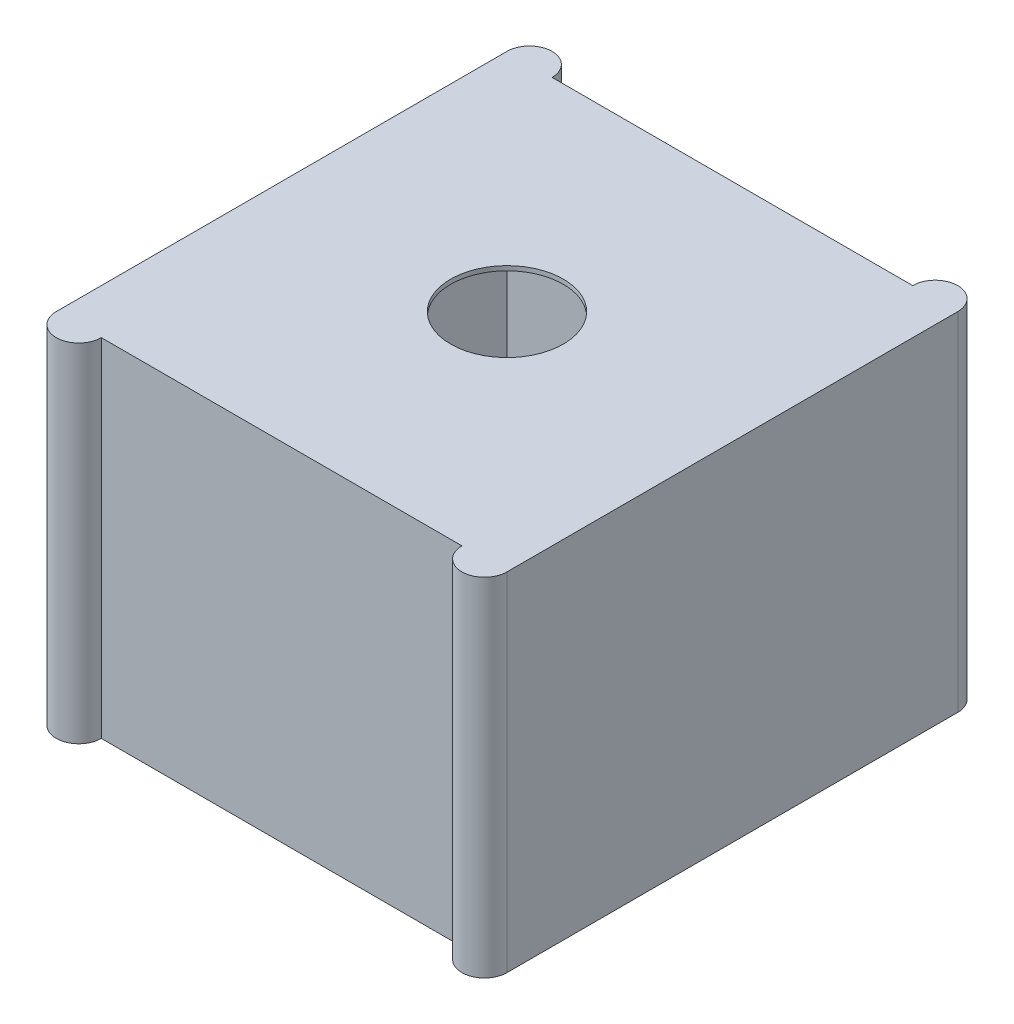
ISO-10303-21;
HEADER;
FILE_DESCRIPTION(('STEP AP214'),'2;1');
FILE_NAME('part.step','',(''),(''),'','','');
FILE_SCHEMA(('AUTOMOTIVE_DESIGN { 1 0 10303 214 1 1 1 1 }'));
ENDSEC;
DATA;
#1=APPLICATION_CONTEXT('core data for automotive mechanical design processes');
#2=APPLICATION_PROTOCOL_DEFINITION('international standard','automotive_design',2000,#1);
#3=PRODUCT_CONTEXT('',#1,'mechanical');
#4=PRODUCT('Part','Part','',(#3));
#5=PRODUCT_RELATED_PRODUCT_CATEGORY('part','',(#4));
#6=PRODUCT_DEFINITION_FORMATION('','',#4);
#7=PRODUCT_DEFINITION_CONTEXT('part definition',#1,'design');
#8=PRODUCT_DEFINITION('design','',#6,#7);
#9=PRODUCT_DEFINITION_SHAPE('','',#8);
#10=(LENGTH_UNIT() NAMED_UNIT(*) SI_UNIT(.MILLI.,.METRE.));
#11=(NAMED_UNIT(*) PLANE_ANGLE_UNIT() SI_UNIT($,.RADIAN.));
#12=(NAMED_UNIT(*) SI_UNIT($,.STERADIAN.) SOLID_ANGLE_UNIT());
#13=UNCERTAINTY_MEASURE_WITH_UNIT(LENGTH_MEASURE(1.E-05),#10,'distance_accuracy_value','');
#14=(GEOMETRIC_REPRESENTATION_CONTEXT(3) GLOBAL_UNCERTAINTY_ASSIGNED_CONTEXT((#13)) GLOBAL_UNIT_ASSIGNED_CONTEXT((#10,
#11,#12)) REPRESENTATION_CONTEXT('',''));
#15=CARTESIAN_POINT('',(0.,0.,0.));
#16=DIRECTION('',(0.,0.,1.));
#17=DIRECTION('',(1.,0.,0.));
#18=AXIS2_PLACEMENT_3D('',#15,#16,#17);
#19=CARTESIAN_POINT('',(0.,154.,0.));
#20=DIRECTION('',(0.,-1.,0.));
#21=DIRECTION('',(0.,0.,-1.));
#22=AXIS2_PLACEMENT_3D('',#19,#20,#21);
#23=CYLINDRICAL_SURFACE('',#22,25.);
#24=CARTESIAN_POINT('',(0.,0.,0.));
#25=DIRECTION('',(0.,1.,0.));
#26=DIRECTION('',(0.,0.,1.));
#27=AXIS2_PLACEMENT_3D('',#24,#25,#26);
#28=CIRCLE('',#27,25.);
#29=CARTESIAN_POINT('',(0.,0.,25.));
#30=VERTEX_POINT('',#29);
#31=EDGE_CURVE('E197',#30,#30,#28,.T.);
#32=ORIENTED_EDGE('',*,*,#31,.F.);
#33=EDGE_LOOP('',(#32));
#34=FACE_BOUND('',#33,.T.);
#35=CARTESIAN_POINT('',(0.,2.,0.));
#36=DIRECTION('',(0.,1.,0.));
#37=DIRECTION('',(0.,0.,1.));
#38=AXIS2_PLACEMENT_3D('',#35,#36,#37);
#39=CIRCLE('',#38,25.);
#40=CARTESIAN_POINT('',(0.,2.,25.));
#41=VERTEX_POINT('',#40);
#42=EDGE_CURVE('E43',#41,#41,#39,.T.);
#43=ORIENTED_EDGE('',*,*,#42,.T.);
#44=EDGE_LOOP('',(#43));
#45=FACE_BOUND('',#44,.T.);
#46=ADVANCED_FACE('F39',(#34,#45),#23,.F.);
#47=CARTESIAN_POINT('',(90.,154.,100.));
#48=DIRECTION('',(0.,-1.,0.));
#49=DIRECTION('',(0.,0.,-1.));
#50=AXIS2_PLACEMENT_3D('',#47,#48,#49);
#51=PLANE('',#50);
#52=CARTESIAN_POINT('',(90.,154.,100.));
#53=DIRECTION('',(0.,1.,0.));
#54=DIRECTION('',(0.,0.,-1.));
#55=AXIS2_PLACEMENT_3D('',#52,#53,#54);
#56=CIRCLE('',#55,9.99999999999999);
#57=CARTESIAN_POINT('',(80.,154.,100.));
#58=VERTEX_POINT('',#57);
#59=CARTESIAN_POINT('',(100.,154.,100.));
#60=VERTEX_POINT('',#59);
#61=EDGE_CURVE('E171',#58,#60,#56,.T.);
#62=ORIENTED_EDGE('',*,*,#61,.T.);
#63=DIRECTION('',(0.,0.,-1.));
#64=VECTOR('',#63,1.);
#65=CARTESIAN_POINT('',(100.,154.,-100.));
#66=LINE('',#65,#64);
#67=CARTESIAN_POINT('',(100.,154.,-100.));
#68=VERTEX_POINT('',#67);
#69=EDGE_CURVE('E103',#60,#68,#66,.T.);
#70=ORIENTED_EDGE('',*,*,#69,.T.);
#71=CARTESIAN_POINT('',(90.,154.,-100.));
#72=DIRECTION('',(0.,1.,0.));
#73=DIRECTION('',(0.,0.,1.));
#74=AXIS2_PLACEMENT_3D('',#71,#72,#73);
#75=CIRCLE('',#74,9.99999999999998);
#76=CARTESIAN_POINT('',(80.,154.,-100.));
#77=VERTEX_POINT('',#76);
#78=EDGE_CURVE('E232',#68,#77,#75,.T.);
#79=ORIENTED_EDGE('',*,*,#78,.T.);
#80=DIRECTION('',(-1.,0.,0.));
#81=VECTOR('',#80,1.);
#82=CARTESIAN_POINT('',(-80.,154.,-100.));
#83=LINE('',#82,#81);
#84=CARTESIAN_POINT('',(-80.,154.,-100.));
#85=VERTEX_POINT('',#84);
#86=EDGE_CURVE('E235',#77,#85,#83,.T.);
#87=ORIENTED_EDGE('',*,*,#86,.T.);
#88=CARTESIAN_POINT('',(-90.,154.,-100.));
#89=DIRECTION('',(0.,1.,0.));
#90=DIRECTION('',(0.,0.,-1.));
#91=AXIS2_PLACEMENT_3D('',#88,#89,#90);
#92=CIRCLE('',#91,9.99999999999999);
#93=CARTESIAN_POINT('',(-100.,154.,-100.));
#94=VERTEX_POINT('',#93);
#95=EDGE_CURVE('E126',#85,#94,#92,.T.);
#96=ORIENTED_EDGE('',*,*,#95,.T.);
#97=DIRECTION('',(0.,0.,1.));
#98=VECTOR('',#97,1.);
#99=CARTESIAN_POINT('',(-100.,154.,-100.));
#100=LINE('',#99,#98);
#101=CARTESIAN_POINT('',(-100.,154.,100.));
#102=VERTEX_POINT('',#101);
#103=EDGE_CURVE('E119',#94,#102,#100,.T.);
#104=ORIENTED_EDGE('',*,*,#103,.T.);
#105=CARTESIAN_POINT('',(-90.,154.,100.));
#106=DIRECTION('',(0.,1.,0.));
#107=DIRECTION('',(0.,0.,1.));
#108=AXIS2_PLACEMENT_3D('',#105,#106,#107);
#109=CIRCLE('',#108,9.99999999999998);
#110=CARTESIAN_POINT('',(-80.0000000000001,154.,100.));
#111=VERTEX_POINT('',#110);
#112=EDGE_CURVE('E124',#102,#111,#109,.T.);
#113=ORIENTED_EDGE('',*,*,#112,.T.);
#114=DIRECTION('',(1.,0.,0.));
#115=VECTOR('',#114,1.);
#116=CARTESIAN_POINT('',(-80.,154.,100.));
#117=LINE('',#116,#115);
#118=EDGE_CURVE('E59',#111,#58,#117,.T.);
#119=ORIENTED_EDGE('',*,*,#118,.T.);
#120=EDGE_LOOP('',(#62,#70,#79,#87,#96,#104,#113,#119));
#121=FACE_BOUND('',#120,.T.);
#122=CARTESIAN_POINT('',(0.,154.,0.));
#123=DIRECTION('',(0.,1.,0.));
#124=DIRECTION('',(0.,0.,1.));
#125=AXIS2_PLACEMENT_3D('',#122,#123,#124);
#126=CIRCLE('',#125,25.);
#127=CARTESIAN_POINT('',(0.,154.,25.));
#128=VERTEX_POINT('',#127);
#129=EDGE_CURVE('E153',#128,#128,#126,.T.);
#130=ORIENTED_EDGE('',*,*,#129,.F.);
#131=EDGE_LOOP('',(#130));
#132=FACE_BOUND('',#131,.T.);
#133=ADVANCED_FACE('F121',(#121,#132),#51,.F.);
#134=CARTESIAN_POINT('',(90.,0.,100.));
#135=DIRECTION('',(0.,-1.,0.));
#136=DIRECTION('',(0.,0.,-1.));
#137=AXIS2_PLACEMENT_3D('',#134,#135,#136);
#138=PLANE('',#137);
#139=CARTESIAN_POINT('',(90.,0.,100.));
#140=DIRECTION('',(0.,1.,0.));
#141=DIRECTION('',(0.,0.,-1.));
#142=AXIS2_PLACEMENT_3D('',#139,#140,#141);
#143=CIRCLE('',#142,9.99999999999999);
#144=CARTESIAN_POINT('',(80.,0.,100.));
#145=VERTEX_POINT('',#144);
#146=CARTESIAN_POINT('',(100.,0.,100.));
#147=VERTEX_POINT('',#146);
#148=EDGE_CURVE('E148',#145,#147,#143,.T.);
#149=ORIENTED_EDGE('',*,*,#148,.F.);
#150=DIRECTION('',(1.,0.,0.));
#151=VECTOR('',#150,1.);
#152=CARTESIAN_POINT('',(-80.,0.,100.));
#153=LINE('',#152,#151);
#154=CARTESIAN_POINT('',(-80.0000000000001,0.,100.));
#155=VERTEX_POINT('',#154);
#156=EDGE_CURVE('E95',#155,#145,#153,.T.);
#157=ORIENTED_EDGE('',*,*,#156,.F.);
#158=CARTESIAN_POINT('',(-90.,0.,100.));
#159=DIRECTION('',(0.,1.,0.));
#160=DIRECTION('',(0.,0.,1.));
#161=AXIS2_PLACEMENT_3D('',#158,#159,#160);
#162=CIRCLE('',#161,9.99999999999998);
#163=CARTESIAN_POINT('',(-100.,0.,100.));
#164=VERTEX_POINT('',#163);
#165=EDGE_CURVE('E89',#164,#155,#162,.T.);
#166=ORIENTED_EDGE('',*,*,#165,.F.);
#167=DIRECTION('',(0.,0.,1.));
#168=VECTOR('',#167,1.);
#169=CARTESIAN_POINT('',(-100.,0.,-100.));
#170=LINE('',#169,#168);
#171=CARTESIAN_POINT('',(-100.,0.,-100.));
#172=VERTEX_POINT('',#171);
#173=EDGE_CURVE('E135',#172,#164,#170,.T.);
#174=ORIENTED_EDGE('',*,*,#173,.F.);
#175=CARTESIAN_POINT('',(-90.,0.,-100.));
#176=DIRECTION('',(0.,1.,0.));
#177=DIRECTION('',(0.,0.,-1.));
#178=AXIS2_PLACEMENT_3D('',#175,#176,#177);
#179=CIRCLE('',#178,9.99999999999999);
#180=CARTESIAN_POINT('',(-80.,0.,-100.));
#181=VERTEX_POINT('',#180);
#182=EDGE_CURVE('E162',#181,#172,#179,.T.);
#183=ORIENTED_EDGE('',*,*,#182,.F.);
#184=DIRECTION('',(-1.,0.,0.));
#185=VECTOR('',#184,1.);
#186=CARTESIAN_POINT('',(-80.,0.,-100.));
#187=LINE('',#186,#185);
#188=CARTESIAN_POINT('',(80.,0.,-100.));
#189=VERTEX_POINT('',#188);
#190=EDGE_CURVE('E159',#189,#181,#187,.T.);
#191=ORIENTED_EDGE('',*,*,#190,.F.);
#192=CARTESIAN_POINT('',(90.,0.,-100.));
#193=DIRECTION('',(0.,1.,0.));
#194=DIRECTION('',(0.,0.,1.));
#195=AXIS2_PLACEMENT_3D('',#192,#193,#194);
#196=CIRCLE('',#195,9.99999999999998);
#197=CARTESIAN_POINT('',(100.,0.,-100.));
#198=VERTEX_POINT('',#197);
#199=EDGE_CURVE('E156',#198,#189,#196,.T.);
#200=ORIENTED_EDGE('',*,*,#199,.F.);
#201=DIRECTION('',(0.,0.,-1.));
#202=VECTOR('',#201,1.);
#203=CARTESIAN_POINT('',(100.,0.,-100.));
#204=LINE('',#203,#202);
#205=EDGE_CURVE('E152',#147,#198,#204,.T.);
#206=ORIENTED_EDGE('',*,*,#205,.F.);
#207=EDGE_LOOP('',(#149,#157,#166,#174,#183,#191,#200,#206));
#208=FACE_BOUND('',#207,.T.);
#209=ORIENTED_EDGE('',*,*,#31,.T.);
#210=EDGE_LOOP('',(#209));
#211=FACE_BOUND('',#210,.T.);
#212=ADVANCED_FACE('F250',(#208,#211),#138,.T.);
#213=CARTESIAN_POINT('',(90.,154.,100.));
#214=DIRECTION('',(0.,-1.,0.));
#215=DIRECTION('',(0.,0.,-1.));
#216=AXIS2_PLACEMENT_3D('',#213,#214,#215);
#217=CYLINDRICAL_SURFACE('',#216,9.99999999999999);
#218=ORIENTED_EDGE('',*,*,#148,.T.);
#219=DIRECTION('',(0.,-1.,0.));
#220=VECTOR('',#219,1.);
#221=CARTESIAN_POINT('',(100.,154.,100.));
#222=LINE('',#221,#220);
#223=EDGE_CURVE('E11',#60,#147,#222,.T.);
#224=ORIENTED_EDGE('',*,*,#223,.F.);
#225=ORIENTED_EDGE('',*,*,#61,.F.);
#226=DIRECTION('',(0.,-1.,0.));
#227=VECTOR('',#226,1.);
#228=CARTESIAN_POINT('',(80.,154.,100.));
#229=LINE('',#228,#227);
#230=EDGE_CURVE('E144',#58,#145,#229,.T.);
#231=ORIENTED_EDGE('',*,*,#230,.T.);
#232=EDGE_LOOP('',(#218,#224,#225,#231));
#233=FACE_BOUND('',#232,.T.);
#234=ADVANCED_FACE('F41',(#233),#217,.T.);
#235=CARTESIAN_POINT('',(100.,154.,-100.));
#236=DIRECTION('',(-1.,0.,0.));
#237=DIRECTION('',(0.,0.,1.));
#238=AXIS2_PLACEMENT_3D('',#235,#236,#237);
#239=PLANE('',#238);
#240=ORIENTED_EDGE('',*,*,#205,.T.);
#241=DIRECTION('',(0.,-1.,0.));
#242=VECTOR('',#241,1.);
#243=CARTESIAN_POINT('',(100.,154.,-100.));
#244=LINE('',#243,#242);
#245=EDGE_CURVE('E50',#68,#198,#244,.T.);
#246=ORIENTED_EDGE('',*,*,#245,.F.);
#247=ORIENTED_EDGE('',*,*,#69,.F.);
#248=ORIENTED_EDGE('',*,*,#223,.T.);
#249=EDGE_LOOP('',(#240,#246,#247,#248));
#250=FACE_BOUND('',#249,.T.);
#251=ADVANCED_FACE('F283',(#250),#239,.F.);
#252=CARTESIAN_POINT('',(90.,154.,-100.));
#253=DIRECTION('',(0.,-1.,0.));
#254=DIRECTION('',(0.,0.,-1.));
#255=AXIS2_PLACEMENT_3D('',#252,#253,#254);
#256=CYLINDRICAL_SURFACE('',#255,9.99999999999998);
#257=ORIENTED_EDGE('',*,*,#199,.T.);
#258=DIRECTION('',(0.,-1.,0.));
#259=VECTOR('',#258,1.);
#260=CARTESIAN_POINT('',(80.,154.,-100.));
#261=LINE('',#260,#259);
#262=EDGE_CURVE('E182',#77,#189,#261,.T.);
#263=ORIENTED_EDGE('',*,*,#262,.F.);
#264=ORIENTED_EDGE('',*,*,#78,.F.);
#265=ORIENTED_EDGE('',*,*,#245,.T.);
#266=EDGE_LOOP('',(#257,#263,#264,#265));
#267=FACE_BOUND('',#266,.T.);
#268=ADVANCED_FACE('F287',(#267),#256,.T.);
#269=CARTESIAN_POINT('',(-80.,154.,-100.));
#270=DIRECTION('',(0.,0.,1.));
#271=DIRECTION('',(1.,0.,0.));
#272=AXIS2_PLACEMENT_3D('',#269,#270,#271);
#273=PLANE('',#272);
#274=ORIENTED_EDGE('',*,*,#190,.T.);
#275=DIRECTION('',(0.,-1.,0.));
#276=VECTOR('',#275,1.);
#277=CARTESIAN_POINT('',(-80.,154.,-100.));
#278=LINE('',#277,#276);
#279=EDGE_CURVE('E178',#85,#181,#278,.T.);
#280=ORIENTED_EDGE('',*,*,#279,.F.);
#281=ORIENTED_EDGE('',*,*,#86,.F.);
#282=ORIENTED_EDGE('',*,*,#262,.T.);
#283=EDGE_LOOP('',(#274,#280,#281,#282));
#284=FACE_BOUND('',#283,.T.);
#285=ADVANCED_FACE('F243',(#284),#273,.F.);
#286=CARTESIAN_POINT('',(-90.,154.,-100.));
#287=DIRECTION('',(0.,-1.,0.));
#288=DIRECTION('',(0.,0.,-1.));
#289=AXIS2_PLACEMENT_3D('',#286,#287,#288);
#290=CYLINDRICAL_SURFACE('',#289,9.99999999999999);
#291=ORIENTED_EDGE('',*,*,#182,.T.);
#292=DIRECTION('',(0.,-1.,0.));
#293=VECTOR('',#292,1.);
#294=CARTESIAN_POINT('',(-100.,154.,-100.));
#295=LINE('',#294,#293);
#296=EDGE_CURVE('E137',#94,#172,#295,.T.);
#297=ORIENTED_EDGE('',*,*,#296,.F.);
#298=ORIENTED_EDGE('',*,*,#95,.F.);
#299=ORIENTED_EDGE('',*,*,#279,.T.);
#300=EDGE_LOOP('',(#291,#297,#298,#299));
#301=FACE_BOUND('',#300,.T.);
#302=ADVANCED_FACE('F247',(#301),#290,.T.);
#303=CARTESIAN_POINT('',(-100.,154.,-100.));
#304=DIRECTION('',(1.,0.,0.));
#305=DIRECTION('',(0.,0.,-1.));
#306=AXIS2_PLACEMENT_3D('',#303,#304,#305);
#307=PLANE('',#306);
#308=ORIENTED_EDGE('',*,*,#173,.T.);
#309=DIRECTION('',(0.,-1.,0.));
#310=VECTOR('',#309,1.);
#311=CARTESIAN_POINT('',(-100.,154.,100.));
#312=LINE('',#311,#310);
#313=EDGE_CURVE('E132',#102,#164,#312,.T.);
#314=ORIENTED_EDGE('',*,*,#313,.F.);
#315=ORIENTED_EDGE('',*,*,#103,.F.);
#316=ORIENTED_EDGE('',*,*,#296,.T.);
#317=EDGE_LOOP('',(#308,#314,#315,#316));
#318=FACE_BOUND('',#317,.T.);
#319=ADVANCED_FACE('F133',(#318),#307,.F.);
#320=CARTESIAN_POINT('',(-90.,154.,100.));
#321=DIRECTION('',(0.,-1.,0.));
#322=DIRECTION('',(0.,0.,-1.));
#323=AXIS2_PLACEMENT_3D('',#320,#321,#322);
#324=CYLINDRICAL_SURFACE('',#323,9.99999999999998);
#325=ORIENTED_EDGE('',*,*,#165,.T.);
#326=DIRECTION('',(0.,-1.,0.));
#327=VECTOR('',#326,1.);
#328=CARTESIAN_POINT('',(-80.0000000000001,154.,100.));
#329=LINE('',#328,#327);
#330=EDGE_CURVE('E138',#111,#155,#329,.T.);
#331=ORIENTED_EDGE('',*,*,#330,.F.);
#332=ORIENTED_EDGE('',*,*,#112,.F.);
#333=ORIENTED_EDGE('',*,*,#313,.T.);
#334=EDGE_LOOP('',(#325,#331,#332,#333));
#335=FACE_BOUND('',#334,.T.);
#336=ADVANCED_FACE('F140',(#335),#324,.T.);
#337=CARTESIAN_POINT('',(-80.,154.,100.));
#338=DIRECTION('',(0.,0.,-1.));
#339=DIRECTION('',(-1.,0.,0.));
#340=AXIS2_PLACEMENT_3D('',#337,#338,#339);
#341=PLANE('',#340);
#342=ORIENTED_EDGE('',*,*,#156,.T.);
#343=ORIENTED_EDGE('',*,*,#230,.F.);
#344=ORIENTED_EDGE('',*,*,#118,.F.);
#345=ORIENTED_EDGE('',*,*,#330,.T.);
#346=EDGE_LOOP('',(#342,#343,#344,#345));
#347=FACE_BOUND('',#346,.T.);
#348=ADVANCED_FACE('F256',(#347),#341,.F.);
#349=CARTESIAN_POINT('',(0.,152.,0.));
#350=DIRECTION('',(0.,1.,0.));
#351=DIRECTION('',(0.,0.,1.));
#352=AXIS2_PLACEMENT_3D('',#349,#350,#351);
#353=CIRCLE('',#352,25.);
#354=CARTESIAN_POINT('',(0.,152.,25.));
#355=VERTEX_POINT('',#354);
#356=EDGE_CURVE('E188',#355,#355,#353,.T.);
#357=ORIENTED_EDGE('',*,*,#356,.F.);
#358=EDGE_LOOP('',(#357));
#359=FACE_BOUND('',#358,.T.);
#360=ORIENTED_EDGE('',*,*,#129,.T.);
#361=EDGE_LOOP('',(#360));
#362=FACE_BOUND('',#361,.T.);
#363=ADVANCED_FACE('F258',(#359,#362),#23,.F.);
#364=CARTESIAN_POINT('',(93.,2.,-93.));
#365=DIRECTION('',(1.,0.,0.));
#366=DIRECTION('',(0.,0.,-1.));
#367=AXIS2_PLACEMENT_3D('',#364,#365,#366);
#368=PLANE('',#367);
#369=DIRECTION('',(0.,0.,-1.));
#370=VECTOR('',#369,1.);
#371=CARTESIAN_POINT('',(93.,152.,-93.));
#372=LINE('',#371,#370);
#373=CARTESIAN_POINT('',(93.,152.,93.));
#374=VERTEX_POINT('',#373);
#375=CARTESIAN_POINT('',(93.,152.,-93.));
#376=VERTEX_POINT('',#375);
#377=EDGE_CURVE('E383',#374,#376,#372,.T.);
#378=ORIENTED_EDGE('',*,*,#377,.T.);
#379=DIRECTION('',(0.,1.,0.));
#380=VECTOR('',#379,1.);
#381=CARTESIAN_POINT('',(93.,2.,-93.));
#382=LINE('',#381,#380);
#383=CARTESIAN_POINT('',(93.,2.,-93.));
#384=VERTEX_POINT('',#383);
#385=EDGE_CURVE('E217',#384,#376,#382,.T.);
#386=ORIENTED_EDGE('',*,*,#385,.F.);
#387=DIRECTION('',(0.,0.,-1.));
#388=VECTOR('',#387,1.);
#389=CARTESIAN_POINT('',(93.,2.,-93.));
#390=LINE('',#389,#388);
#391=CARTESIAN_POINT('',(93.,2.,93.));
#392=VERTEX_POINT('',#391);
#393=EDGE_CURVE('E398',#392,#384,#390,.T.);
#394=ORIENTED_EDGE('',*,*,#393,.F.);
#395=DIRECTION('',(0.,1.,0.));
#396=VECTOR('',#395,1.);
#397=CARTESIAN_POINT('',(93.,2.,93.));
#398=LINE('',#397,#396);
#399=EDGE_CURVE('E191',#392,#374,#398,.T.);
#400=ORIENTED_EDGE('',*,*,#399,.T.);
#401=EDGE_LOOP('',(#378,#386,#394,#400));
#402=FACE_BOUND('',#401,.T.);
#403=ADVANCED_FACE('F264',(#402),#368,.F.);
#404=CARTESIAN_POINT('',(-93.,2.,93.));
#405=DIRECTION('',(0.,0.,1.));
#406=DIRECTION('',(1.,0.,0.));
#407=AXIS2_PLACEMENT_3D('',#404,#405,#406);
#408=PLANE('',#407);
#409=DIRECTION('',(1.,0.,0.));
#410=VECTOR('',#409,1.);
#411=CARTESIAN_POINT('',(-93.,152.,93.));
#412=LINE('',#411,#410);
#413=CARTESIAN_POINT('',(-93.,152.,93.));
#414=VERTEX_POINT('',#413);
#415=EDGE_CURVE('E211',#414,#374,#412,.T.);
#416=ORIENTED_EDGE('',*,*,#415,.T.);
#417=ORIENTED_EDGE('',*,*,#399,.F.);
#418=DIRECTION('',(1.,0.,0.));
#419=VECTOR('',#418,1.);
#420=CARTESIAN_POINT('',(-93.,2.,93.));
#421=LINE('',#420,#419);
#422=CARTESIAN_POINT('',(-93.,2.,93.));
#423=VERTEX_POINT('',#422);
#424=EDGE_CURVE('E221',#423,#392,#421,.T.);
#425=ORIENTED_EDGE('',*,*,#424,.F.);
#426=DIRECTION('',(0.,1.,0.));
#427=VECTOR('',#426,1.);
#428=CARTESIAN_POINT('',(-93.,2.,93.));
#429=LINE('',#428,#427);
#430=EDGE_CURVE('E199',#423,#414,#429,.T.);
#431=ORIENTED_EDGE('',*,*,#430,.T.);
#432=EDGE_LOOP('',(#416,#417,#425,#431));
#433=FACE_BOUND('',#432,.T.);
#434=ADVANCED_FACE('F330',(#433),#408,.F.);
#435=CARTESIAN_POINT('',(-93.,2.,-93.));
#436=DIRECTION('',(-1.,0.,0.));
#437=DIRECTION('',(0.,0.,1.));
#438=AXIS2_PLACEMENT_3D('',#435,#436,#437);
#439=PLANE('',#438);
#440=DIRECTION('',(0.,0.,1.));
#441=VECTOR('',#440,1.);
#442=CARTESIAN_POINT('',(-93.,152.,-93.));
#443=LINE('',#442,#441);
#444=CARTESIAN_POINT('',(-93.,152.,-93.));
#445=VERTEX_POINT('',#444);
#446=EDGE_CURVE('E399',#445,#414,#443,.T.);
#447=ORIENTED_EDGE('',*,*,#446,.T.);
#448=ORIENTED_EDGE('',*,*,#430,.F.);
#449=DIRECTION('',(0.,0.,1.));
#450=VECTOR('',#449,1.);
#451=CARTESIAN_POINT('',(-93.,2.,-93.));
#452=LINE('',#451,#450);
#453=CARTESIAN_POINT('',(-93.,2.,-93.));
#454=VERTEX_POINT('',#453);
#455=EDGE_CURVE('E411',#454,#423,#452,.T.);
#456=ORIENTED_EDGE('',*,*,#455,.F.);
#457=DIRECTION('',(0.,1.,0.));
#458=VECTOR('',#457,1.);
#459=CARTESIAN_POINT('',(-93.,2.,-93.));
#460=LINE('',#459,#458);
#461=EDGE_CURVE('E208',#454,#445,#460,.T.);
#462=ORIENTED_EDGE('',*,*,#461,.T.);
#463=EDGE_LOOP('',(#447,#448,#456,#462));
#464=FACE_BOUND('',#463,.T.);
#465=ADVANCED_FACE('F338',(#464),#439,.F.);
#466=CARTESIAN_POINT('',(-93.,2.,-93.));
#467=DIRECTION('',(0.,0.,-1.));
#468=DIRECTION('',(-1.,0.,0.));
#469=AXIS2_PLACEMENT_3D('',#466,#467,#468);
#470=PLANE('',#469);
#471=DIRECTION('',(-1.,0.,0.));
#472=VECTOR('',#471,1.);
#473=CARTESIAN_POINT('',(-93.,152.,-93.));
#474=LINE('',#473,#472);
#475=EDGE_CURVE('E389',#376,#445,#474,.T.);
#476=ORIENTED_EDGE('',*,*,#475,.T.);
#477=ORIENTED_EDGE('',*,*,#461,.F.);
#478=DIRECTION('',(-1.,0.,0.));
#479=VECTOR('',#478,1.);
#480=CARTESIAN_POINT('',(-93.,2.,-93.));
#481=LINE('',#480,#479);
#482=EDGE_CURVE('E403',#384,#454,#481,.T.);
#483=ORIENTED_EDGE('',*,*,#482,.F.);
#484=ORIENTED_EDGE('',*,*,#385,.T.);
#485=EDGE_LOOP('',(#476,#477,#483,#484));
#486=FACE_BOUND('',#485,.T.);
#487=ADVANCED_FACE('F348',(#486),#470,.F.);
#488=CARTESIAN_POINT('',(0.,2.,0.));
#489=DIRECTION('',(0.,1.,0.));
#490=DIRECTION('',(0.,0.,1.));
#491=AXIS2_PLACEMENT_3D('',#488,#489,#490);
#492=PLANE('',#491);
#493=ORIENTED_EDGE('',*,*,#42,.F.);
#494=EDGE_LOOP('',(#493));
#495=FACE_BOUND('',#494,.T.);
#496=ORIENTED_EDGE('',*,*,#393,.T.);
#497=ORIENTED_EDGE('',*,*,#482,.T.);
#498=ORIENTED_EDGE('',*,*,#455,.T.);
#499=ORIENTED_EDGE('',*,*,#424,.T.);
#500=EDGE_LOOP('',(#496,#497,#498,#499));
#501=FACE_BOUND('',#500,.T.);
#502=ADVANCED_FACE('F358',(#495,#501),#492,.T.);
#503=CARTESIAN_POINT('',(0.,152.,0.));
#504=DIRECTION('',(0.,1.,0.));
#505=DIRECTION('',(0.,0.,1.));
#506=AXIS2_PLACEMENT_3D('',#503,#504,#505);
#507=PLANE('',#506);
#508=ORIENTED_EDGE('',*,*,#356,.T.);
#509=EDGE_LOOP('',(#508));
#510=FACE_BOUND('',#509,.T.);
#511=ORIENTED_EDGE('',*,*,#377,.F.);
#512=ORIENTED_EDGE('',*,*,#415,.F.);
#513=ORIENTED_EDGE('',*,*,#446,.F.);
#514=ORIENTED_EDGE('',*,*,#475,.F.);
#515=EDGE_LOOP('',(#511,#512,#513,#514));
#516=FACE_BOUND('',#515,.T.);
#517=ADVANCED_FACE('F367',(#510,#516),#507,.F.);
#518=CLOSED_SHELL('',(#46,#133,#212,#234,#251,#268,#285,#302,#319,#336,#348,#363,#403,#434,#465,
#487,#502,#517));
#519=MANIFOLD_SOLID_BREP('B2',#518);
#520=ADVANCED_BREP_SHAPE_REPRESENTATION('',(#18,#519),#14);
#521=SHAPE_DEFINITION_REPRESENTATION(#9,#520);
ENDSEC;
END-ISO-10303-21;
